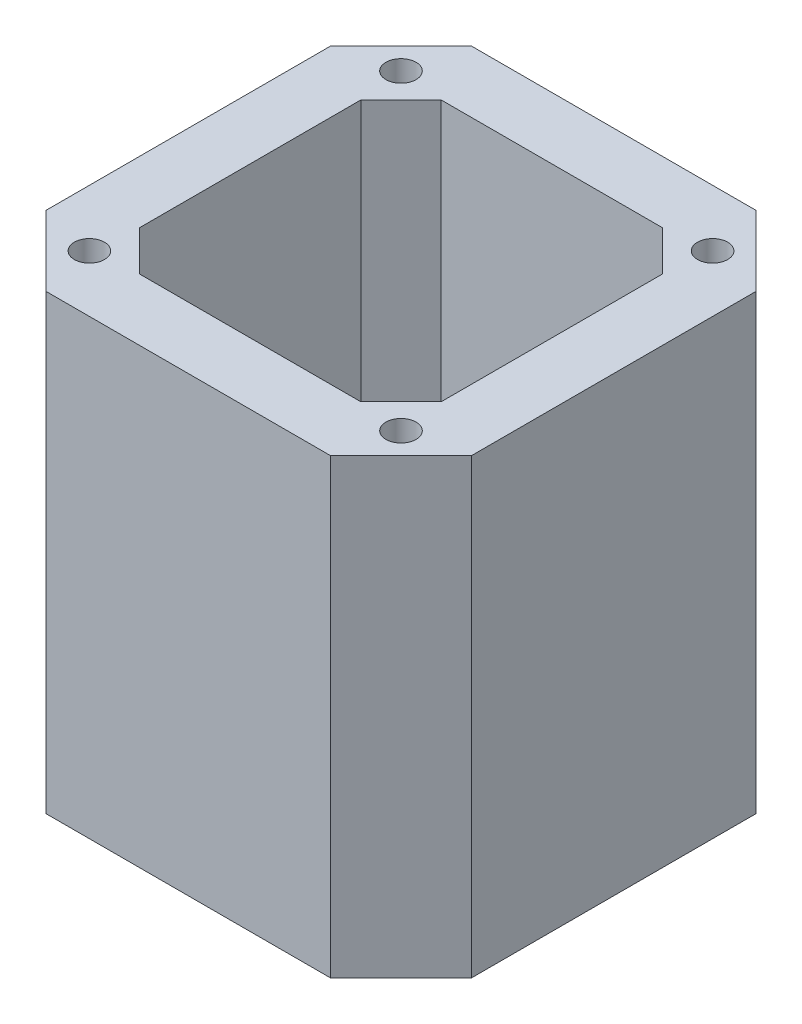
ISO-10303-21;
HEADER;
FILE_DESCRIPTION(('STEP AP214'),'2;1');
FILE_NAME('part.step','',(''),(''),'','','');
FILE_SCHEMA(('AUTOMOTIVE_DESIGN { 1 0 10303 214 1 1 1 1 }'));
ENDSEC;
DATA;
#1=APPLICATION_CONTEXT('core data for automotive mechanical design processes');
#2=APPLICATION_PROTOCOL_DEFINITION('international standard','automotive_design',2000,#1);
#3=PRODUCT_CONTEXT('',#1,'mechanical');
#4=PRODUCT('Part','Part','',(#3));
#5=PRODUCT_RELATED_PRODUCT_CATEGORY('part','',(#4));
#6=PRODUCT_DEFINITION_FORMATION('','',#4);
#7=PRODUCT_DEFINITION_CONTEXT('part definition',#1,'design');
#8=PRODUCT_DEFINITION('design','',#6,#7);
#9=PRODUCT_DEFINITION_SHAPE('','',#8);
#10=(LENGTH_UNIT() NAMED_UNIT(*) SI_UNIT(.MILLI.,.METRE.));
#11=(NAMED_UNIT(*) PLANE_ANGLE_UNIT() SI_UNIT($,.RADIAN.));
#12=(NAMED_UNIT(*) SI_UNIT($,.STERADIAN.) SOLID_ANGLE_UNIT());
#13=UNCERTAINTY_MEASURE_WITH_UNIT(LENGTH_MEASURE(1.E-05),#10,'distance_accuracy_value','');
#14=(GEOMETRIC_REPRESENTATION_CONTEXT(3) GLOBAL_UNCERTAINTY_ASSIGNED_CONTEXT((#13)) GLOBAL_UNIT_ASSIGNED_CONTEXT((#10,
#11,#12)) REPRESENTATION_CONTEXT('',''));
#15=CARTESIAN_POINT('',(0.,0.,0.));
#16=DIRECTION('',(0.,0.,1.));
#17=DIRECTION('',(1.,0.,0.));
#18=AXIS2_PLACEMENT_3D('',#15,#16,#17);
#19=CARTESIAN_POINT('',(-14.15,45.,-21.15));
#20=DIRECTION('',(0.,0.,1.));
#21=DIRECTION('',(1.,0.,0.));
#22=AXIS2_PLACEMENT_3D('',#19,#20,#21);
#23=PLANE('',#22);
#24=DIRECTION('',(-1.,0.,0.));
#25=VECTOR('',#24,1.);
#26=CARTESIAN_POINT('',(-14.15,0.,-21.15));
#27=LINE('',#26,#25);
#28=CARTESIAN_POINT('',(14.15,0.,-21.15));
#29=VERTEX_POINT('',#28);
#30=CARTESIAN_POINT('',(-14.15,0.,-21.15));
#31=VERTEX_POINT('',#30);
#32=EDGE_CURVE('E235',#29,#31,#27,.T.);
#33=ORIENTED_EDGE('',*,*,#32,.T.);
#34=DIRECTION('',(0.,-1.,0.));
#35=VECTOR('',#34,1.);
#36=CARTESIAN_POINT('',(-14.15,45.,-21.15));
#37=LINE('',#36,#35);
#38=CARTESIAN_POINT('',(-14.15,45.,-21.15));
#39=VERTEX_POINT('',#38);
#40=EDGE_CURVE('E11',#39,#31,#37,.T.);
#41=ORIENTED_EDGE('',*,*,#40,.F.);
#42=DIRECTION('',(-1.,0.,0.));
#43=VECTOR('',#42,1.);
#44=CARTESIAN_POINT('',(-14.15,45.,-21.15));
#45=LINE('',#44,#43);
#46=CARTESIAN_POINT('',(14.15,45.,-21.15));
#47=VERTEX_POINT('',#46);
#48=EDGE_CURVE('E238',#47,#39,#45,.T.);
#49=ORIENTED_EDGE('',*,*,#48,.F.);
#50=DIRECTION('',(0.,-1.,0.));
#51=VECTOR('',#50,1.);
#52=CARTESIAN_POINT('',(14.15,45.,-21.15));
#53=LINE('',#52,#51);
#54=EDGE_CURVE('E256',#47,#29,#53,.T.);
#55=ORIENTED_EDGE('',*,*,#54,.T.);
#56=EDGE_LOOP('',(#33,#41,#49,#55));
#57=FACE_BOUND('',#56,.T.);
#58=ADVANCED_FACE('F33',(#57),#23,.F.);
#59=CARTESIAN_POINT('',(-21.15,45.,-14.15));
#60=DIRECTION('',(0.707106781186547,0.,0.707106781186547));
#61=DIRECTION('',(0.707106781186548,0.,-0.707106781186548));
#62=AXIS2_PLACEMENT_3D('',#59,#60,#61);
#63=PLANE('',#62);
#64=DIRECTION('',(-0.707106781186547,0.,0.707106781186547));
#65=VECTOR('',#64,1.);
#66=CARTESIAN_POINT('',(-21.15,0.,-14.15));
#67=LINE('',#66,#65);
#68=CARTESIAN_POINT('',(-21.15,0.,-14.15));
#69=VERTEX_POINT('',#68);
#70=EDGE_CURVE('E259',#31,#69,#67,.T.);
#71=ORIENTED_EDGE('',*,*,#70,.T.);
#72=DIRECTION('',(0.,-1.,0.));
#73=VECTOR('',#72,1.);
#74=CARTESIAN_POINT('',(-21.15,45.,-14.15));
#75=LINE('',#74,#73);
#76=CARTESIAN_POINT('',(-21.15,45.,-14.15));
#77=VERTEX_POINT('',#76);
#78=EDGE_CURVE('E40',#77,#69,#75,.T.);
#79=ORIENTED_EDGE('',*,*,#78,.F.);
#80=DIRECTION('',(-0.707106781186547,0.,0.707106781186547));
#81=VECTOR('',#80,1.);
#82=CARTESIAN_POINT('',(-21.15,45.,-14.15));
#83=LINE('',#82,#81);
#84=EDGE_CURVE('E241',#39,#77,#83,.T.);
#85=ORIENTED_EDGE('',*,*,#84,.F.);
#86=ORIENTED_EDGE('',*,*,#40,.T.);
#87=EDGE_LOOP('',(#71,#79,#85,#86));
#88=FACE_BOUND('',#87,.T.);
#89=ADVANCED_FACE('F314',(#88),#63,.F.);
#90=CARTESIAN_POINT('',(-21.15,45.,-14.15));
#91=DIRECTION('',(1.,0.,0.));
#92=DIRECTION('',(0.,0.,-1.));
#93=AXIS2_PLACEMENT_3D('',#90,#91,#92);
#94=PLANE('',#93);
#95=DIRECTION('',(0.,0.,1.));
#96=VECTOR('',#95,1.);
#97=CARTESIAN_POINT('',(-21.15,0.,-14.15));
#98=LINE('',#97,#96);
#99=CARTESIAN_POINT('',(-21.15,0.,14.15));
#100=VERTEX_POINT('',#99);
#101=EDGE_CURVE('E261',#69,#100,#98,.T.);
#102=ORIENTED_EDGE('',*,*,#101,.T.);
#103=DIRECTION('',(0.,-1.,0.));
#104=VECTOR('',#103,1.);
#105=CARTESIAN_POINT('',(-21.15,45.,14.15));
#106=LINE('',#105,#104);
#107=CARTESIAN_POINT('',(-21.15,45.,14.15));
#108=VERTEX_POINT('',#107);
#109=EDGE_CURVE('E286',#108,#100,#106,.T.);
#110=ORIENTED_EDGE('',*,*,#109,.F.);
#111=DIRECTION('',(0.,0.,1.));
#112=VECTOR('',#111,1.);
#113=CARTESIAN_POINT('',(-21.15,45.,-14.15));
#114=LINE('',#113,#112);
#115=EDGE_CURVE('E244',#77,#108,#114,.T.);
#116=ORIENTED_EDGE('',*,*,#115,.F.);
#117=ORIENTED_EDGE('',*,*,#78,.T.);
#118=EDGE_LOOP('',(#102,#110,#116,#117));
#119=FACE_BOUND('',#118,.T.);
#120=ADVANCED_FACE('F293',(#119),#94,.F.);
#121=CARTESIAN_POINT('',(-21.15,45.,14.15));
#122=DIRECTION('',(0.707106781186547,0.,-0.707106781186547));
#123=DIRECTION('',(-0.707106781186548,0.,-0.707106781186548));
#124=AXIS2_PLACEMENT_3D('',#121,#122,#123);
#125=PLANE('',#124);
#126=DIRECTION('',(0.707106781186547,0.,0.707106781186547));
#127=VECTOR('',#126,1.);
#128=CARTESIAN_POINT('',(-21.15,0.,14.15));
#129=LINE('',#128,#127);
#130=CARTESIAN_POINT('',(-14.15,0.,21.15));
#131=VERTEX_POINT('',#130);
#132=EDGE_CURVE('E263',#100,#131,#129,.T.);
#133=ORIENTED_EDGE('',*,*,#132,.T.);
#134=DIRECTION('',(0.,-1.,0.));
#135=VECTOR('',#134,1.);
#136=CARTESIAN_POINT('',(-14.15,45.,21.15));
#137=LINE('',#136,#135);
#138=CARTESIAN_POINT('',(-14.15,45.,21.15));
#139=VERTEX_POINT('',#138);
#140=EDGE_CURVE('E283',#139,#131,#137,.T.);
#141=ORIENTED_EDGE('',*,*,#140,.F.);
#142=DIRECTION('',(0.707106781186547,0.,0.707106781186547));
#143=VECTOR('',#142,1.);
#144=CARTESIAN_POINT('',(-21.15,45.,14.15));
#145=LINE('',#144,#143);
#146=EDGE_CURVE('E246',#108,#139,#145,.T.);
#147=ORIENTED_EDGE('',*,*,#146,.F.);
#148=ORIENTED_EDGE('',*,*,#109,.T.);
#149=EDGE_LOOP('',(#133,#141,#147,#148));
#150=FACE_BOUND('',#149,.T.);
#151=ADVANCED_FACE('F302',(#150),#125,.F.);
#152=CARTESIAN_POINT('',(-14.15,45.,21.15));
#153=DIRECTION('',(0.,0.,-1.));
#154=DIRECTION('',(-1.,0.,0.));
#155=AXIS2_PLACEMENT_3D('',#152,#153,#154);
#156=PLANE('',#155);
#157=DIRECTION('',(1.,0.,0.));
#158=VECTOR('',#157,1.);
#159=CARTESIAN_POINT('',(-14.15,0.,21.15));
#160=LINE('',#159,#158);
#161=CARTESIAN_POINT('',(14.15,0.,21.15));
#162=VERTEX_POINT('',#161);
#163=EDGE_CURVE('E265',#131,#162,#160,.T.);
#164=ORIENTED_EDGE('',*,*,#163,.T.);
#165=DIRECTION('',(0.,-1.,0.));
#166=VECTOR('',#165,1.);
#167=CARTESIAN_POINT('',(14.15,45.,21.15));
#168=LINE('',#167,#166);
#169=CARTESIAN_POINT('',(14.15,45.,21.15));
#170=VERTEX_POINT('',#169);
#171=EDGE_CURVE('E280',#170,#162,#168,.T.);
#172=ORIENTED_EDGE('',*,*,#171,.F.);
#173=DIRECTION('',(1.,0.,0.));
#174=VECTOR('',#173,1.);
#175=CARTESIAN_POINT('',(-14.15,45.,21.15));
#176=LINE('',#175,#174);
#177=EDGE_CURVE('E248',#139,#170,#176,.T.);
#178=ORIENTED_EDGE('',*,*,#177,.F.);
#179=ORIENTED_EDGE('',*,*,#140,.T.);
#180=EDGE_LOOP('',(#164,#172,#178,#179));
#181=FACE_BOUND('',#180,.T.);
#182=ADVANCED_FACE('F306',(#181),#156,.F.);
#183=CARTESIAN_POINT('',(14.15,45.,21.15));
#184=DIRECTION('',(-0.707106781186547,0.,-0.707106781186547));
#185=DIRECTION('',(-0.707106781186548,0.,0.707106781186548));
#186=AXIS2_PLACEMENT_3D('',#183,#184,#185);
#187=PLANE('',#186);
#188=DIRECTION('',(0.707106781186547,0.,-0.707106781186547));
#189=VECTOR('',#188,1.);
#190=CARTESIAN_POINT('',(14.15,0.,21.15));
#191=LINE('',#190,#189);
#192=CARTESIAN_POINT('',(21.15,0.,14.15));
#193=VERTEX_POINT('',#192);
#194=EDGE_CURVE('E267',#162,#193,#191,.T.);
#195=ORIENTED_EDGE('',*,*,#194,.T.);
#196=DIRECTION('',(0.,-1.,0.));
#197=VECTOR('',#196,1.);
#198=CARTESIAN_POINT('',(21.15,45.,14.15));
#199=LINE('',#198,#197);
#200=CARTESIAN_POINT('',(21.15,45.,14.15));
#201=VERTEX_POINT('',#200);
#202=EDGE_CURVE('E277',#201,#193,#199,.T.);
#203=ORIENTED_EDGE('',*,*,#202,.F.);
#204=DIRECTION('',(0.707106781186547,0.,-0.707106781186547));
#205=VECTOR('',#204,1.);
#206=CARTESIAN_POINT('',(14.15,45.,21.15));
#207=LINE('',#206,#205);
#208=EDGE_CURVE('E250',#170,#201,#207,.T.);
#209=ORIENTED_EDGE('',*,*,#208,.F.);
#210=ORIENTED_EDGE('',*,*,#171,.T.);
#211=EDGE_LOOP('',(#195,#203,#209,#210));
#212=FACE_BOUND('',#211,.T.);
#213=ADVANCED_FACE('F327',(#212),#187,.F.);
#214=CARTESIAN_POINT('',(21.15,45.,-14.15));
#215=DIRECTION('',(-1.,0.,0.));
#216=DIRECTION('',(0.,0.,1.));
#217=AXIS2_PLACEMENT_3D('',#214,#215,#216);
#218=PLANE('',#217);
#219=DIRECTION('',(0.,0.,-1.));
#220=VECTOR('',#219,1.);
#221=CARTESIAN_POINT('',(21.15,0.,-14.15));
#222=LINE('',#221,#220);
#223=CARTESIAN_POINT('',(21.15,0.,-14.15));
#224=VERTEX_POINT('',#223);
#225=EDGE_CURVE('E269',#193,#224,#222,.T.);
#226=ORIENTED_EDGE('',*,*,#225,.T.);
#227=DIRECTION('',(0.,-1.,0.));
#228=VECTOR('',#227,1.);
#229=CARTESIAN_POINT('',(21.15,45.,-14.15));
#230=LINE('',#229,#228);
#231=CARTESIAN_POINT('',(21.15,45.,-14.15));
#232=VERTEX_POINT('',#231);
#233=EDGE_CURVE('E274',#232,#224,#230,.T.);
#234=ORIENTED_EDGE('',*,*,#233,.F.);
#235=DIRECTION('',(0.,0.,-1.));
#236=VECTOR('',#235,1.);
#237=CARTESIAN_POINT('',(21.15,45.,-14.15));
#238=LINE('',#237,#236);
#239=EDGE_CURVE('E252',#201,#232,#238,.T.);
#240=ORIENTED_EDGE('',*,*,#239,.F.);
#241=ORIENTED_EDGE('',*,*,#202,.T.);
#242=EDGE_LOOP('',(#226,#234,#240,#241));
#243=FACE_BOUND('',#242,.T.);
#244=ADVANCED_FACE('F325',(#243),#218,.F.);
#245=CARTESIAN_POINT('',(14.15,45.,-21.15));
#246=DIRECTION('',(-0.707106781186547,0.,0.707106781186547));
#247=DIRECTION('',(0.707106781186548,0.,0.707106781186548));
#248=AXIS2_PLACEMENT_3D('',#245,#246,#247);
#249=PLANE('',#248);
#250=DIRECTION('',(-0.707106781186547,0.,-0.707106781186547));
#251=VECTOR('',#250,1.);
#252=CARTESIAN_POINT('',(14.15,0.,-21.15));
#253=LINE('',#252,#251);
#254=EDGE_CURVE('E242',#224,#29,#253,.T.);
#255=ORIENTED_EDGE('',*,*,#254,.T.);
#256=ORIENTED_EDGE('',*,*,#54,.F.);
#257=DIRECTION('',(-0.707106781186547,0.,-0.707106781186547));
#258=VECTOR('',#257,1.);
#259=CARTESIAN_POINT('',(14.15,45.,-21.15));
#260=LINE('',#259,#258);
#261=EDGE_CURVE('E254',#232,#47,#260,.T.);
#262=ORIENTED_EDGE('',*,*,#261,.F.);
#263=ORIENTED_EDGE('',*,*,#233,.T.);
#264=EDGE_LOOP('',(#255,#256,#262,#263));
#265=FACE_BOUND('',#264,.T.);
#266=ADVANCED_FACE('F320',(#265),#249,.F.);
#267=CARTESIAN_POINT('',(0.,45.,0.));
#268=DIRECTION('',(0.,-1.,0.));
#269=DIRECTION('',(0.,0.,-1.));
#270=AXIS2_PLACEMENT_3D('',#267,#268,#269);
#271=PLANE('',#270);
#272=DIRECTION('',(-0.707106781186548,0.,0.707106781186548));
#273=VECTOR('',#272,1.);
#274=CARTESIAN_POINT('',(-15.,45.,-11.));
#275=LINE('',#274,#273);
#276=CARTESIAN_POINT('',(-11.,45.,-15.));
#277=VERTEX_POINT('',#276);
#278=CARTESIAN_POINT('',(-15.,45.,-11.));
#279=VERTEX_POINT('',#278);
#280=EDGE_CURVE('E184',#277,#279,#275,.T.);
#281=ORIENTED_EDGE('',*,*,#280,.F.);
#282=DIRECTION('',(-1.,0.,0.));
#283=VECTOR('',#282,1.);
#284=CARTESIAN_POINT('',(-11.,45.,-15.));
#285=LINE('',#284,#283);
#286=CARTESIAN_POINT('',(11.,45.,-15.));
#287=VERTEX_POINT('',#286);
#288=EDGE_CURVE('E47',#287,#277,#285,.T.);
#289=ORIENTED_EDGE('',*,*,#288,.F.);
#290=DIRECTION('',(-0.707106781186548,0.,-0.707106781186548));
#291=VECTOR('',#290,1.);
#292=CARTESIAN_POINT('',(11.,45.,-15.));
#293=LINE('',#292,#291);
#294=CARTESIAN_POINT('',(15.,45.,-11.));
#295=VERTEX_POINT('',#294);
#296=EDGE_CURVE('E164',#295,#287,#293,.T.);
#297=ORIENTED_EDGE('',*,*,#296,.F.);
#298=DIRECTION('',(0.,0.,-1.));
#299=VECTOR('',#298,1.);
#300=CARTESIAN_POINT('',(15.,45.,-11.));
#301=LINE('',#300,#299);
#302=CARTESIAN_POINT('',(15.,45.,11.));
#303=VERTEX_POINT('',#302);
#304=EDGE_CURVE('E167',#303,#295,#301,.T.);
#305=ORIENTED_EDGE('',*,*,#304,.F.);
#306=DIRECTION('',(0.707106781186548,0.,-0.707106781186548));
#307=VECTOR('',#306,1.);
#308=CARTESIAN_POINT('',(11.,45.,15.));
#309=LINE('',#308,#307);
#310=CARTESIAN_POINT('',(11.,45.,15.));
#311=VERTEX_POINT('',#310);
#312=EDGE_CURVE('E195',#311,#303,#309,.T.);
#313=ORIENTED_EDGE('',*,*,#312,.F.);
#314=DIRECTION('',(1.,0.,0.));
#315=VECTOR('',#314,1.);
#316=CARTESIAN_POINT('',(-11.,45.,15.));
#317=LINE('',#316,#315);
#318=CARTESIAN_POINT('',(-11.,45.,15.));
#319=VERTEX_POINT('',#318);
#320=EDGE_CURVE('E192',#319,#311,#317,.T.);
#321=ORIENTED_EDGE('',*,*,#320,.F.);
#322=DIRECTION('',(0.707106781186548,0.,0.707106781186548));
#323=VECTOR('',#322,1.);
#324=CARTESIAN_POINT('',(-15.,45.,11.));
#325=LINE('',#324,#323);
#326=CARTESIAN_POINT('',(-15.,45.,11.));
#327=VERTEX_POINT('',#326);
#328=EDGE_CURVE('E189',#327,#319,#325,.T.);
#329=ORIENTED_EDGE('',*,*,#328,.F.);
#330=DIRECTION('',(0.,0.,1.));
#331=VECTOR('',#330,1.);
#332=CARTESIAN_POINT('',(-15.,45.,-11.));
#333=LINE('',#332,#331);
#334=EDGE_CURVE('E186',#279,#327,#333,.T.);
#335=ORIENTED_EDGE('',*,*,#334,.F.);
#336=EDGE_LOOP('',(#281,#289,#297,#305,#313,#321,#329,#335));
#337=FACE_BOUND('',#336,.T.);
#338=CARTESIAN_POINT('',(15.5,45.,-15.5));
#339=DIRECTION('',(0.,1.,0.));
#340=DIRECTION('',(0.,0.,1.));
#341=AXIS2_PLACEMENT_3D('',#338,#339,#340);
#342=CIRCLE('',#341,1.5);
#343=CARTESIAN_POINT('',(15.5,45.,-14.));
#344=VERTEX_POINT('',#343);
#345=EDGE_CURVE('E224',#344,#344,#342,.T.);
#346=ORIENTED_EDGE('',*,*,#345,.F.);
#347=EDGE_LOOP('',(#346));
#348=FACE_BOUND('',#347,.T.);
#349=CARTESIAN_POINT('',(-15.5,45.,15.5));
#350=DIRECTION('',(0.,1.,0.));
#351=DIRECTION('',(0.,0.,1.));
#352=AXIS2_PLACEMENT_3D('',#349,#350,#351);
#353=CIRCLE('',#352,1.5);
#354=CARTESIAN_POINT('',(-15.5,45.,17.));
#355=VERTEX_POINT('',#354);
#356=EDGE_CURVE('E217',#355,#355,#353,.T.);
#357=ORIENTED_EDGE('',*,*,#356,.F.);
#358=EDGE_LOOP('',(#357));
#359=FACE_BOUND('',#358,.T.);
#360=CARTESIAN_POINT('',(15.5,45.,15.5));
#361=DIRECTION('',(0.,1.,0.));
#362=DIRECTION('',(0.,0.,1.));
#363=AXIS2_PLACEMENT_3D('',#360,#361,#362);
#364=CIRCLE('',#363,1.5);
#365=CARTESIAN_POINT('',(15.5,45.,17.));
#366=VERTEX_POINT('',#365);
#367=EDGE_CURVE('E202',#366,#366,#364,.T.);
#368=ORIENTED_EDGE('',*,*,#367,.F.);
#369=EDGE_LOOP('',(#368));
#370=FACE_BOUND('',#369,.T.);
#371=CARTESIAN_POINT('',(-15.5,45.,-15.5));
#372=DIRECTION('',(0.,1.,0.));
#373=DIRECTION('',(0.,0.,1.));
#374=AXIS2_PLACEMENT_3D('',#371,#372,#373);
#375=CIRCLE('',#374,1.5);
#376=CARTESIAN_POINT('',(-15.5,45.,-14.));
#377=VERTEX_POINT('',#376);
#378=EDGE_CURVE('E223',#377,#377,#375,.T.);
#379=ORIENTED_EDGE('',*,*,#378,.F.);
#380=EDGE_LOOP('',(#379));
#381=FACE_BOUND('',#380,.T.);
#382=ORIENTED_EDGE('',*,*,#48,.T.);
#383=ORIENTED_EDGE('',*,*,#84,.T.);
#384=ORIENTED_EDGE('',*,*,#115,.T.);
#385=ORIENTED_EDGE('',*,*,#146,.T.);
#386=ORIENTED_EDGE('',*,*,#177,.T.);
#387=ORIENTED_EDGE('',*,*,#208,.T.);
#388=ORIENTED_EDGE('',*,*,#239,.T.);
#389=ORIENTED_EDGE('',*,*,#261,.T.);
#390=EDGE_LOOP('',(#382,#383,#384,#385,#386,#387,#388,#389));
#391=FACE_BOUND('',#390,.T.);
#392=ADVANCED_FACE('F310',(#337,#348,#359,#370,#381,#391),#271,.F.);
#393=CARTESIAN_POINT('',(0.,0.,0.));
#394=DIRECTION('',(0.,-1.,0.));
#395=DIRECTION('',(0.,0.,-1.));
#396=AXIS2_PLACEMENT_3D('',#393,#394,#395);
#397=PLANE('',#396);
#398=DIRECTION('',(-1.,0.,0.));
#399=VECTOR('',#398,1.);
#400=CARTESIAN_POINT('',(-11.,0.,-15.));
#401=LINE('',#400,#399);
#402=CARTESIAN_POINT('',(11.,0.,-15.));
#403=VERTEX_POINT('',#402);
#404=CARTESIAN_POINT('',(-11.,0.,-15.));
#405=VERTEX_POINT('',#404);
#406=EDGE_CURVE('E147',#403,#405,#401,.T.);
#407=ORIENTED_EDGE('',*,*,#406,.T.);
#408=DIRECTION('',(-0.707106781186548,0.,0.707106781186548));
#409=VECTOR('',#408,1.);
#410=CARTESIAN_POINT('',(-15.,0.,-11.));
#411=LINE('',#410,#409);
#412=CARTESIAN_POINT('',(-15.,0.,-11.));
#413=VERTEX_POINT('',#412);
#414=EDGE_CURVE('E156',#405,#413,#411,.T.);
#415=ORIENTED_EDGE('',*,*,#414,.T.);
#416=DIRECTION('',(0.,0.,1.));
#417=VECTOR('',#416,1.);
#418=CARTESIAN_POINT('',(-15.,0.,-11.));
#419=LINE('',#418,#417);
#420=CARTESIAN_POINT('',(-15.,0.,11.));
#421=VERTEX_POINT('',#420);
#422=EDGE_CURVE('E55',#413,#421,#419,.T.);
#423=ORIENTED_EDGE('',*,*,#422,.T.);
#424=DIRECTION('',(0.707106781186548,0.,0.707106781186548));
#425=VECTOR('',#424,1.);
#426=CARTESIAN_POINT('',(-15.,0.,11.));
#427=LINE('',#426,#425);
#428=CARTESIAN_POINT('',(-11.,0.,15.));
#429=VERTEX_POINT('',#428);
#430=EDGE_CURVE('E171',#421,#429,#427,.T.);
#431=ORIENTED_EDGE('',*,*,#430,.T.);
#432=DIRECTION('',(1.,0.,0.));
#433=VECTOR('',#432,1.);
#434=CARTESIAN_POINT('',(-11.,0.,15.));
#435=LINE('',#434,#433);
#436=CARTESIAN_POINT('',(11.,0.,15.));
#437=VERTEX_POINT('',#436);
#438=EDGE_CURVE('E174',#429,#437,#435,.T.);
#439=ORIENTED_EDGE('',*,*,#438,.T.);
#440=DIRECTION('',(0.707106781186548,0.,-0.707106781186548));
#441=VECTOR('',#440,1.);
#442=CARTESIAN_POINT('',(11.,0.,15.));
#443=LINE('',#442,#441);
#444=CARTESIAN_POINT('',(15.,0.,11.));
#445=VERTEX_POINT('',#444);
#446=EDGE_CURVE('E177',#437,#445,#443,.T.);
#447=ORIENTED_EDGE('',*,*,#446,.T.);
#448=DIRECTION('',(0.,0.,-1.));
#449=VECTOR('',#448,1.);
#450=CARTESIAN_POINT('',(15.,0.,-11.));
#451=LINE('',#450,#449);
#452=CARTESIAN_POINT('',(15.,0.,-11.));
#453=VERTEX_POINT('',#452);
#454=EDGE_CURVE('E180',#445,#453,#451,.T.);
#455=ORIENTED_EDGE('',*,*,#454,.T.);
#456=DIRECTION('',(-0.707106781186548,0.,-0.707106781186548));
#457=VECTOR('',#456,1.);
#458=CARTESIAN_POINT('',(11.,0.,-15.));
#459=LINE('',#458,#457);
#460=EDGE_CURVE('E153',#453,#403,#459,.T.);
#461=ORIENTED_EDGE('',*,*,#460,.T.);
#462=EDGE_LOOP('',(#407,#415,#423,#431,#439,#447,#455,#461));
#463=FACE_BOUND('',#462,.T.);
#464=ORIENTED_EDGE('',*,*,#32,.F.);
#465=ORIENTED_EDGE('',*,*,#254,.F.);
#466=ORIENTED_EDGE('',*,*,#225,.F.);
#467=ORIENTED_EDGE('',*,*,#194,.F.);
#468=ORIENTED_EDGE('',*,*,#163,.F.);
#469=ORIENTED_EDGE('',*,*,#132,.F.);
#470=ORIENTED_EDGE('',*,*,#101,.F.);
#471=ORIENTED_EDGE('',*,*,#70,.F.);
#472=EDGE_LOOP('',(#464,#465,#466,#467,#468,#469,#470,#471));
#473=FACE_BOUND('',#472,.T.);
#474=ADVANCED_FACE('F160',(#463,#473),#397,.T.);
#475=CARTESIAN_POINT('',(-15.5,40.,-15.5));
#476=DIRECTION('',(0.,1.,0.));
#477=DIRECTION('',(0.,0.,1.));
#478=AXIS2_PLACEMENT_3D('',#475,#476,#477);
#479=CYLINDRICAL_SURFACE('',#478,1.5);
#480=CARTESIAN_POINT('',(-15.5,40.,-15.5));
#481=DIRECTION('',(0.,1.,0.));
#482=DIRECTION('',(0.,0.,1.));
#483=AXIS2_PLACEMENT_3D('',#480,#481,#482);
#484=CIRCLE('',#483,1.5);
#485=CARTESIAN_POINT('',(-15.5,40.,-14.));
#486=VERTEX_POINT('',#485);
#487=EDGE_CURVE('E232',#486,#486,#484,.T.);
#488=ORIENTED_EDGE('',*,*,#487,.F.);
#489=EDGE_LOOP('',(#488));
#490=FACE_BOUND('',#489,.T.);
#491=ORIENTED_EDGE('',*,*,#378,.T.);
#492=EDGE_LOOP('',(#491));
#493=FACE_BOUND('',#492,.T.);
#494=ADVANCED_FACE('F379',(#490,#493),#479,.F.);
#495=CARTESIAN_POINT('',(-15.5,40.,-15.5));
#496=DIRECTION('',(0.,1.,0.));
#497=DIRECTION('',(0.,0.,1.));
#498=AXIS2_PLACEMENT_3D('',#495,#496,#497);
#499=PLANE('',#498);
#500=ORIENTED_EDGE('',*,*,#487,.T.);
#501=EDGE_LOOP('',(#500));
#502=FACE_BOUND('',#501,.T.);
#503=ADVANCED_FACE('F384',(#502),#499,.T.);
#504=CARTESIAN_POINT('',(15.5,40.,15.5));
#505=DIRECTION('',(0.,1.,0.));
#506=DIRECTION('',(0.,0.,1.));
#507=AXIS2_PLACEMENT_3D('',#504,#505,#506);
#508=CYLINDRICAL_SURFACE('',#507,1.5);
#509=CARTESIAN_POINT('',(15.5,40.,15.5));
#510=DIRECTION('',(0.,1.,0.));
#511=DIRECTION('',(0.,0.,1.));
#512=AXIS2_PLACEMENT_3D('',#509,#510,#511);
#513=CIRCLE('',#512,1.5);
#514=CARTESIAN_POINT('',(15.5,40.,17.));
#515=VERTEX_POINT('',#514);
#516=EDGE_CURVE('E214',#515,#515,#513,.T.);
#517=ORIENTED_EDGE('',*,*,#516,.F.);
#518=EDGE_LOOP('',(#517));
#519=FACE_BOUND('',#518,.T.);
#520=ORIENTED_EDGE('',*,*,#367,.T.);
#521=EDGE_LOOP('',(#520));
#522=FACE_BOUND('',#521,.T.);
#523=ADVANCED_FACE('F396',(#519,#522),#508,.F.);
#524=CARTESIAN_POINT('',(15.5,40.,15.5));
#525=DIRECTION('',(0.,1.,0.));
#526=DIRECTION('',(0.,0.,1.));
#527=AXIS2_PLACEMENT_3D('',#524,#525,#526);
#528=PLANE('',#527);
#529=ORIENTED_EDGE('',*,*,#516,.T.);
#530=EDGE_LOOP('',(#529));
#531=FACE_BOUND('',#530,.T.);
#532=ADVANCED_FACE('F406',(#531),#528,.T.);
#533=CARTESIAN_POINT('',(-15.5,40.,15.5));
#534=DIRECTION('',(0.,1.,0.));
#535=DIRECTION('',(0.,0.,1.));
#536=AXIS2_PLACEMENT_3D('',#533,#534,#535);
#537=CYLINDRICAL_SURFACE('',#536,1.5);
#538=CARTESIAN_POINT('',(-15.5,40.,15.5));
#539=DIRECTION('',(0.,1.,0.));
#540=DIRECTION('',(0.,0.,1.));
#541=AXIS2_PLACEMENT_3D('',#538,#539,#540);
#542=CIRCLE('',#541,1.5);
#543=CARTESIAN_POINT('',(-15.5,40.,17.));
#544=VERTEX_POINT('',#543);
#545=EDGE_CURVE('E227',#544,#544,#542,.T.);
#546=ORIENTED_EDGE('',*,*,#545,.F.);
#547=EDGE_LOOP('',(#546));
#548=FACE_BOUND('',#547,.T.);
#549=ORIENTED_EDGE('',*,*,#356,.T.);
#550=EDGE_LOOP('',(#549));
#551=FACE_BOUND('',#550,.T.);
#552=ADVANCED_FACE('F416',(#548,#551),#537,.F.);
#553=CARTESIAN_POINT('',(-15.5,40.,15.5));
#554=DIRECTION('',(0.,1.,0.));
#555=DIRECTION('',(0.,0.,1.));
#556=AXIS2_PLACEMENT_3D('',#553,#554,#555);
#557=PLANE('',#556);
#558=ORIENTED_EDGE('',*,*,#545,.T.);
#559=EDGE_LOOP('',(#558));
#560=FACE_BOUND('',#559,.T.);
#561=ADVANCED_FACE('F426',(#560),#557,.T.);
#562=CARTESIAN_POINT('',(15.5,40.,-15.5));
#563=DIRECTION('',(0.,1.,0.));
#564=DIRECTION('',(0.,0.,1.));
#565=AXIS2_PLACEMENT_3D('',#562,#563,#564);
#566=CYLINDRICAL_SURFACE('',#565,1.5);
#567=CARTESIAN_POINT('',(15.5,40.,-15.5));
#568=DIRECTION('',(0.,1.,0.));
#569=DIRECTION('',(0.,0.,1.));
#570=AXIS2_PLACEMENT_3D('',#567,#568,#569);
#571=CIRCLE('',#570,1.5);
#572=CARTESIAN_POINT('',(15.5,40.,-14.));
#573=VERTEX_POINT('',#572);
#574=EDGE_CURVE('E220',#573,#573,#571,.T.);
#575=ORIENTED_EDGE('',*,*,#574,.F.);
#576=EDGE_LOOP('',(#575));
#577=FACE_BOUND('',#576,.T.);
#578=ORIENTED_EDGE('',*,*,#345,.T.);
#579=EDGE_LOOP('',(#578));
#580=FACE_BOUND('',#579,.T.);
#581=ADVANCED_FACE('F436',(#577,#580),#566,.F.);
#582=CARTESIAN_POINT('',(15.5,40.,-15.5));
#583=DIRECTION('',(0.,1.,0.));
#584=DIRECTION('',(0.,0.,1.));
#585=AXIS2_PLACEMENT_3D('',#582,#583,#584);
#586=PLANE('',#585);
#587=ORIENTED_EDGE('',*,*,#574,.T.);
#588=EDGE_LOOP('',(#587));
#589=FACE_BOUND('',#588,.T.);
#590=ADVANCED_FACE('F446',(#589),#586,.T.);
#591=CARTESIAN_POINT('',(-11.,0.,-15.));
#592=DIRECTION('',(0.,0.,-1.));
#593=DIRECTION('',(-1.,0.,0.));
#594=AXIS2_PLACEMENT_3D('',#591,#592,#593);
#595=PLANE('',#594);
#596=ORIENTED_EDGE('',*,*,#288,.T.);
#597=DIRECTION('',(0.,1.,0.));
#598=VECTOR('',#597,1.);
#599=CARTESIAN_POINT('',(-11.,0.,-15.));
#600=LINE('',#599,#598);
#601=EDGE_CURVE('E143',#405,#277,#600,.T.);
#602=ORIENTED_EDGE('',*,*,#601,.F.);
#603=ORIENTED_EDGE('',*,*,#406,.F.);
#604=DIRECTION('',(0.,1.,0.));
#605=VECTOR('',#604,1.);
#606=CARTESIAN_POINT('',(11.,0.,-15.));
#607=LINE('',#606,#605);
#608=EDGE_CURVE('E200',#403,#287,#607,.T.);
#609=ORIENTED_EDGE('',*,*,#608,.T.);
#610=EDGE_LOOP('',(#596,#602,#603,#609));
#611=FACE_BOUND('',#610,.T.);
#612=ADVANCED_FACE('F145',(#611),#595,.F.);
#613=CARTESIAN_POINT('',(11.,0.,-15.));
#614=DIRECTION('',(0.707106781186547,0.,-0.707106781186547));
#615=DIRECTION('',(-0.707106781186548,0.,-0.707106781186548));
#616=AXIS2_PLACEMENT_3D('',#613,#614,#615);
#617=PLANE('',#616);
#618=ORIENTED_EDGE('',*,*,#296,.T.);
#619=ORIENTED_EDGE('',*,*,#608,.F.);
#620=ORIENTED_EDGE('',*,*,#460,.F.);
#621=DIRECTION('',(0.,1.,0.));
#622=VECTOR('',#621,1.);
#623=CARTESIAN_POINT('',(15.,0.,-11.));
#624=LINE('',#623,#622);
#625=EDGE_CURVE('E203',#453,#295,#624,.T.);
#626=ORIENTED_EDGE('',*,*,#625,.T.);
#627=EDGE_LOOP('',(#618,#619,#620,#626));
#628=FACE_BOUND('',#627,.T.);
#629=ADVANCED_FACE('F478',(#628),#617,.F.);
#630=CARTESIAN_POINT('',(15.,0.,-11.));
#631=DIRECTION('',(1.,0.,0.));
#632=DIRECTION('',(0.,0.,-1.));
#633=AXIS2_PLACEMENT_3D('',#630,#631,#632);
#634=PLANE('',#633);
#635=ORIENTED_EDGE('',*,*,#304,.T.);
#636=ORIENTED_EDGE('',*,*,#625,.F.);
#637=ORIENTED_EDGE('',*,*,#454,.F.);
#638=DIRECTION('',(0.,1.,0.));
#639=VECTOR('',#638,1.);
#640=CARTESIAN_POINT('',(15.,0.,11.));
#641=LINE('',#640,#639);
#642=EDGE_CURVE('E205',#445,#303,#641,.T.);
#643=ORIENTED_EDGE('',*,*,#642,.T.);
#644=EDGE_LOOP('',(#635,#636,#637,#643));
#645=FACE_BOUND('',#644,.T.);
#646=ADVANCED_FACE('F487',(#645),#634,.F.);
#647=CARTESIAN_POINT('',(11.,0.,15.));
#648=DIRECTION('',(0.707106781186547,0.,0.707106781186547));
#649=DIRECTION('',(0.707106781186548,0.,-0.707106781186548));
#650=AXIS2_PLACEMENT_3D('',#647,#648,#649);
#651=PLANE('',#650);
#652=ORIENTED_EDGE('',*,*,#312,.T.);
#653=ORIENTED_EDGE('',*,*,#642,.F.);
#654=ORIENTED_EDGE('',*,*,#446,.F.);
#655=DIRECTION('',(0.,1.,0.));
#656=VECTOR('',#655,1.);
#657=CARTESIAN_POINT('',(11.,0.,15.));
#658=LINE('',#657,#656);
#659=EDGE_CURVE('E207',#437,#311,#658,.T.);
#660=ORIENTED_EDGE('',*,*,#659,.T.);
#661=EDGE_LOOP('',(#652,#653,#654,#660));
#662=FACE_BOUND('',#661,.T.);
#663=ADVANCED_FACE('F497',(#662),#651,.F.);
#664=CARTESIAN_POINT('',(-11.,0.,15.));
#665=DIRECTION('',(0.,0.,1.));
#666=DIRECTION('',(1.,0.,0.));
#667=AXIS2_PLACEMENT_3D('',#664,#665,#666);
#668=PLANE('',#667);
#669=ORIENTED_EDGE('',*,*,#320,.T.);
#670=ORIENTED_EDGE('',*,*,#659,.F.);
#671=ORIENTED_EDGE('',*,*,#438,.F.);
#672=DIRECTION('',(0.,1.,0.));
#673=VECTOR('',#672,1.);
#674=CARTESIAN_POINT('',(-11.,0.,15.));
#675=LINE('',#674,#673);
#676=EDGE_CURVE('E209',#429,#319,#675,.T.);
#677=ORIENTED_EDGE('',*,*,#676,.T.);
#678=EDGE_LOOP('',(#669,#670,#671,#677));
#679=FACE_BOUND('',#678,.T.);
#680=ADVANCED_FACE('F507',(#679),#668,.F.);
#681=CARTESIAN_POINT('',(-15.,0.,11.));
#682=DIRECTION('',(-0.707106781186547,0.,0.707106781186547));
#683=DIRECTION('',(0.707106781186548,0.,0.707106781186548));
#684=AXIS2_PLACEMENT_3D('',#681,#682,#683);
#685=PLANE('',#684);
#686=ORIENTED_EDGE('',*,*,#328,.T.);
#687=ORIENTED_EDGE('',*,*,#676,.F.);
#688=ORIENTED_EDGE('',*,*,#430,.F.);
#689=DIRECTION('',(0.,1.,0.));
#690=VECTOR('',#689,1.);
#691=CARTESIAN_POINT('',(-15.,0.,11.));
#692=LINE('',#691,#690);
#693=EDGE_CURVE('E211',#421,#327,#692,.T.);
#694=ORIENTED_EDGE('',*,*,#693,.T.);
#695=EDGE_LOOP('',(#686,#687,#688,#694));
#696=FACE_BOUND('',#695,.T.);
#697=ADVANCED_FACE('F517',(#696),#685,.F.);
#698=CARTESIAN_POINT('',(-15.,0.,-11.));
#699=DIRECTION('',(-1.,0.,0.));
#700=DIRECTION('',(0.,0.,1.));
#701=AXIS2_PLACEMENT_3D('',#698,#699,#700);
#702=PLANE('',#701);
#703=ORIENTED_EDGE('',*,*,#334,.T.);
#704=ORIENTED_EDGE('',*,*,#693,.F.);
#705=ORIENTED_EDGE('',*,*,#422,.F.);
#706=DIRECTION('',(0.,1.,0.));
#707=VECTOR('',#706,1.);
#708=CARTESIAN_POINT('',(-15.,0.,-11.));
#709=LINE('',#708,#707);
#710=EDGE_CURVE('E152',#413,#279,#709,.T.);
#711=ORIENTED_EDGE('',*,*,#710,.T.);
#712=EDGE_LOOP('',(#703,#704,#705,#711));
#713=FACE_BOUND('',#712,.T.);
#714=ADVANCED_FACE('F527',(#713),#702,.F.);
#715=CARTESIAN_POINT('',(-15.,0.,-11.));
#716=DIRECTION('',(-0.707106781186547,0.,-0.707106781186547));
#717=DIRECTION('',(-0.707106781186548,0.,0.707106781186548));
#718=AXIS2_PLACEMENT_3D('',#715,#716,#717);
#719=PLANE('',#718);
#720=ORIENTED_EDGE('',*,*,#280,.T.);
#721=ORIENTED_EDGE('',*,*,#710,.F.);
#722=ORIENTED_EDGE('',*,*,#414,.F.);
#723=ORIENTED_EDGE('',*,*,#601,.T.);
#724=EDGE_LOOP('',(#720,#721,#722,#723));
#725=FACE_BOUND('',#724,.T.);
#726=ADVANCED_FACE('F157',(#725),#719,.F.);
#727=CLOSED_SHELL('',(#58,#89,#120,#151,#182,#213,#244,#266,#392,#474,#494,#503,#523,#532,#552,
#561,#581,#590,#612,#629,#646,#663,#680,#697,#714,#726));
#728=MANIFOLD_SOLID_BREP('B2',#727);
#729=ADVANCED_BREP_SHAPE_REPRESENTATION('',(#18,#728),#14);
#730=SHAPE_DEFINITION_REPRESENTATION(#9,#729);
ENDSEC;
END-ISO-10303-21;
